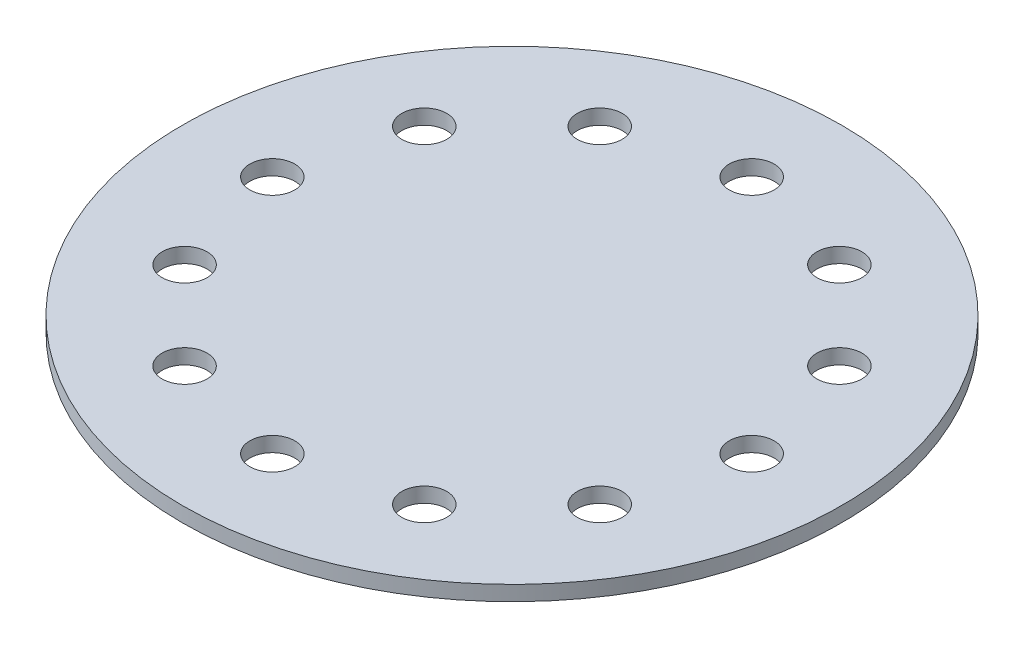
ISO-10303-21;
HEADER;
FILE_DESCRIPTION(('STEP AP214'),'2;1');
FILE_NAME('part.step','',(''),(''),'','','');
FILE_SCHEMA(('AUTOMOTIVE_DESIGN { 1 0 10303 214 1 1 1 1 }'));
ENDSEC;
DATA;
#1=APPLICATION_CONTEXT('core data for automotive mechanical design processes');
#2=APPLICATION_PROTOCOL_DEFINITION('international standard','automotive_design',2000,#1);
#3=PRODUCT_CONTEXT('',#1,'mechanical');
#4=PRODUCT('Part','Part','',(#3));
#5=PRODUCT_RELATED_PRODUCT_CATEGORY('part','',(#4));
#6=PRODUCT_DEFINITION_FORMATION('','',#4);
#7=PRODUCT_DEFINITION_CONTEXT('part definition',#1,'design');
#8=PRODUCT_DEFINITION('design','',#6,#7);
#9=PRODUCT_DEFINITION_SHAPE('','',#8);
#10=(LENGTH_UNIT() NAMED_UNIT(*) SI_UNIT(.MILLI.,.METRE.));
#11=(NAMED_UNIT(*) PLANE_ANGLE_UNIT() SI_UNIT($,.RADIAN.));
#12=(NAMED_UNIT(*) SI_UNIT($,.STERADIAN.) SOLID_ANGLE_UNIT());
#13=UNCERTAINTY_MEASURE_WITH_UNIT(LENGTH_MEASURE(1.E-05),#10,'distance_accuracy_value','');
#14=(GEOMETRIC_REPRESENTATION_CONTEXT(3) GLOBAL_UNCERTAINTY_ASSIGNED_CONTEXT((#13)) GLOBAL_UNIT_ASSIGNED_CONTEXT((#10,
#11,#12)) REPRESENTATION_CONTEXT('',''));
#15=CARTESIAN_POINT('',(0.,0.,0.));
#16=DIRECTION('',(0.,0.,1.));
#17=DIRECTION('',(1.,0.,0.));
#18=AXIS2_PLACEMENT_3D('',#15,#16,#17);
#19=CARTESIAN_POINT('',(0.,1.,0.));
#20=DIRECTION('',(0.,1.,0.));
#21=DIRECTION('',(0.,0.,1.));
#22=AXIS2_PLACEMENT_3D('',#19,#20,#21);
#23=PLANE('',#22);
#24=CARTESIAN_POINT('',(-13.8564064605507,1.,-7.9999999999994));
#25=DIRECTION('',(0.,1.,0.));
#26=DIRECTION('',(0.,0.,1.));
#27=AXIS2_PLACEMENT_3D('',#24,#25,#26);
#28=CIRCLE('',#27,1.50000000000069);
#29=CARTESIAN_POINT('',(-13.8564064605507,1.,-6.49999999999871));
#30=VERTEX_POINT('',#29);
#31=EDGE_CURVE('E132',#30,#30,#28,.T.);
#32=ORIENTED_EDGE('',*,*,#31,.F.);
#33=EDGE_LOOP('',(#32));
#34=FACE_BOUND('',#33,.T.);
#35=CARTESIAN_POINT('',(-13.85640646055,1.,8.0000000000006));
#36=DIRECTION('',(0.,1.,0.));
#37=DIRECTION('',(0.,0.,1.));
#38=AXIS2_PLACEMENT_3D('',#35,#36,#37);
#39=CIRCLE('',#38,1.50000000000129);
#40=CARTESIAN_POINT('',(-13.85640646055,1.,9.50000000000189));
#41=VERTEX_POINT('',#40);
#42=EDGE_CURVE('E116',#41,#41,#39,.T.);
#43=ORIENTED_EDGE('',*,*,#42,.F.);
#44=EDGE_LOOP('',(#43));
#45=FACE_BOUND('',#44,.T.);
#46=CARTESIAN_POINT('',(1.35836374802349E-12,1.,16.));
#47=DIRECTION('',(0.,1.,0.));
#48=DIRECTION('',(0.,0.,1.));
#49=AXIS2_PLACEMENT_3D('',#46,#47,#48);
#50=CIRCLE('',#49,1.50000000000141);
#51=CARTESIAN_POINT('',(1.35836374802349E-12,1.,17.5000000000014));
#52=VERTEX_POINT('',#51);
#53=EDGE_CURVE('E100',#52,#52,#50,.T.);
#54=ORIENTED_EDGE('',*,*,#53,.F.);
#55=EDGE_LOOP('',(#54));
#56=FACE_BOUND('',#55,.T.);
#57=CARTESIAN_POINT('',(13.856406460552,1.,7.99999999999941));
#58=DIRECTION('',(0.,1.,0.));
#59=DIRECTION('',(0.,0.,1.));
#60=AXIS2_PLACEMENT_3D('',#57,#58,#59);
#61=CIRCLE('',#60,1.50000000000088);
#62=CARTESIAN_POINT('',(13.856406460552,1.,9.50000000000029));
#63=VERTEX_POINT('',#62);
#64=EDGE_CURVE('E84',#63,#63,#61,.T.);
#65=ORIENTED_EDGE('',*,*,#64,.F.);
#66=EDGE_LOOP('',(#65));
#67=FACE_BOUND('',#66,.T.);
#68=CARTESIAN_POINT('',(13.8564064605514,1.,-8.00000000000059));
#69=DIRECTION('',(0.,1.,0.));
#70=DIRECTION('',(0.,0.,1.));
#71=AXIS2_PLACEMENT_3D('',#68,#69,#70);
#72=CIRCLE('',#71,1.50000000000019);
#73=CARTESIAN_POINT('',(13.8564064605514,1.,-6.5000000000004));
#74=VERTEX_POINT('',#73);
#75=EDGE_CURVE('E68',#74,#74,#72,.T.);
#76=ORIENTED_EDGE('',*,*,#75,.F.);
#77=EDGE_LOOP('',(#76));
#78=FACE_BOUND('',#77,.T.);
#79=CARTESIAN_POINT('',(0.,1.,-16.));
#80=DIRECTION('',(0.,1.,0.));
#81=DIRECTION('',(0.,0.,1.));
#82=AXIS2_PLACEMENT_3D('',#79,#80,#81);
#83=CIRCLE('',#82,1.5);
#84=CARTESIAN_POINT('',(0.,1.,-14.5));
#85=VERTEX_POINT('',#84);
#86=EDGE_CURVE('E54',#85,#85,#83,.T.);
#87=ORIENTED_EDGE('',*,*,#86,.F.);
#88=EDGE_LOOP('',(#87));
#89=FACE_BOUND('',#88,.T.);
#90=CARTESIAN_POINT('',(0.,1.,0.));
#91=DIRECTION('',(0.,1.,0.));
#92=DIRECTION('',(0.,0.,1.));
#93=AXIS2_PLACEMENT_3D('',#90,#91,#92);
#94=CIRCLE('',#93,22.);
#95=CARTESIAN_POINT('',(0.,1.,22.));
#96=VERTEX_POINT('',#95);
#97=EDGE_CURVE('E10',#96,#96,#94,.T.);
#98=ORIENTED_EDGE('',*,*,#97,.T.);
#99=EDGE_LOOP('',(#98));
#100=FACE_BOUND('',#99,.T.);
#101=CARTESIAN_POINT('',(8.00000000000002,1.,-13.856406460551));
#102=DIRECTION('',(0.,1.,0.));
#103=DIRECTION('',(0.,0.,1.));
#104=AXIS2_PLACEMENT_3D('',#101,#102,#103);
#105=CIRCLE('',#104,1.5);
#106=CARTESIAN_POINT('',(8.00000000000002,1.,-12.356406460551));
#107=VERTEX_POINT('',#106);
#108=EDGE_CURVE('E60',#107,#107,#105,.T.);
#109=ORIENTED_EDGE('',*,*,#108,.F.);
#110=EDGE_LOOP('',(#109));
#111=FACE_BOUND('',#110,.T.);
#112=CARTESIAN_POINT('',(16.0000000000007,1.,-6.79181874011743E-13));
#113=DIRECTION('',(0.,1.,0.));
#114=DIRECTION('',(0.,0.,1.));
#115=AXIS2_PLACEMENT_3D('',#112,#113,#114);
#116=CIRCLE('',#115,1.50000000000051);
#117=CARTESIAN_POINT('',(16.0000000000007,1.,1.49999999999983));
#118=VERTEX_POINT('',#117);
#119=EDGE_CURVE('E76',#118,#118,#116,.T.);
#120=ORIENTED_EDGE('',*,*,#119,.F.);
#121=EDGE_LOOP('',(#120));
#122=FACE_BOUND('',#121,.T.);
#123=CARTESIAN_POINT('',(8.00000000000127,1.,13.8564064605507));
#124=DIRECTION('',(0.,1.,0.));
#125=DIRECTION('',(0.,0.,1.));
#126=AXIS2_PLACEMENT_3D('',#123,#124,#125);
#127=CIRCLE('',#126,1.50000000000121);
#128=CARTESIAN_POINT('',(8.00000000000127,1.,15.3564064605519));
#129=VERTEX_POINT('',#128);
#130=EDGE_CURVE('E92',#129,#129,#127,.T.);
#131=ORIENTED_EDGE('',*,*,#130,.F.);
#132=EDGE_LOOP('',(#131));
#133=FACE_BOUND('',#132,.T.);
#134=CARTESIAN_POINT('',(-7.99999999999873,1.,13.8564064605514));
#135=DIRECTION('',(0.,1.,0.));
#136=DIRECTION('',(0.,0.,1.));
#137=AXIS2_PLACEMENT_3D('',#134,#135,#136);
#138=CIRCLE('',#137,1.50000000000144);
#139=CARTESIAN_POINT('',(-7.99999999999873,1.,15.3564064605528));
#140=VERTEX_POINT('',#139);
#141=EDGE_CURVE('E108',#140,#140,#138,.T.);
#142=ORIENTED_EDGE('',*,*,#141,.F.);
#143=EDGE_LOOP('',(#142));
#144=FACE_BOUND('',#143,.T.);
#145=CARTESIAN_POINT('',(-15.9999999999993,1.,6.81141308890378E-13));
#146=DIRECTION('',(0.,1.,0.));
#147=DIRECTION('',(0.,0.,1.));
#148=AXIS2_PLACEMENT_3D('',#145,#146,#147);
#149=CIRCLE('',#148,1.50000000000101);
#150=CARTESIAN_POINT('',(-15.9999999999993,1.,1.50000000000169));
#151=VERTEX_POINT('',#150);
#152=EDGE_CURVE('E124',#151,#151,#149,.T.);
#153=ORIENTED_EDGE('',*,*,#152,.F.);
#154=EDGE_LOOP('',(#153));
#155=FACE_BOUND('',#154,.T.);
#156=CARTESIAN_POINT('',(-7.99999999999982,1.,-13.8564064605511));
#157=DIRECTION('',(0.,1.,0.));
#158=DIRECTION('',(0.,0.,1.));
#159=AXIS2_PLACEMENT_3D('',#156,#157,#158);
#160=CIRCLE('',#159,1.5);
#161=CARTESIAN_POINT('',(-7.99999999999982,1.,-12.3564064605511));
#162=VERTEX_POINT('',#161);
#163=EDGE_CURVE('E140',#162,#162,#160,.T.);
#164=ORIENTED_EDGE('',*,*,#163,.F.);
#165=EDGE_LOOP('',(#164));
#166=FACE_BOUND('',#165,.T.);
#167=ADVANCED_FACE('F41',(#34,#45,#56,#67,#78,#89,#100,#111,#122,#133,#144,#155,#166),#23,.T.);
#168=CARTESIAN_POINT('',(0.,0.,0.));
#169=DIRECTION('',(0.,1.,0.));
#170=DIRECTION('',(0.,0.,1.));
#171=AXIS2_PLACEMENT_3D('',#168,#169,#170);
#172=PLANE('',#171);
#173=CARTESIAN_POINT('',(0.,0.,0.));
#174=DIRECTION('',(0.,1.,0.));
#175=DIRECTION('',(0.,0.,1.));
#176=AXIS2_PLACEMENT_3D('',#173,#174,#175);
#177=CIRCLE('',#176,22.);
#178=CARTESIAN_POINT('',(0.,0.,22.));
#179=VERTEX_POINT('',#178);
#180=EDGE_CURVE('E45',#179,#179,#177,.T.);
#181=ORIENTED_EDGE('',*,*,#180,.F.);
#182=EDGE_LOOP('',(#181));
#183=FACE_BOUND('',#182,.T.);
#184=CARTESIAN_POINT('',(0.,0.,-16.));
#185=DIRECTION('',(0.,1.,0.));
#186=DIRECTION('',(0.,0.,1.));
#187=AXIS2_PLACEMENT_3D('',#184,#185,#186);
#188=CIRCLE('',#187,1.5);
#189=CARTESIAN_POINT('',(0.,0.,-14.5));
#190=VERTEX_POINT('',#189);
#191=EDGE_CURVE('E56',#190,#190,#188,.T.);
#192=ORIENTED_EDGE('',*,*,#191,.T.);
#193=EDGE_LOOP('',(#192));
#194=FACE_BOUND('',#193,.T.);
#195=CARTESIAN_POINT('',(8.00000000000002,0.,-13.856406460551));
#196=DIRECTION('',(0.,1.,0.));
#197=DIRECTION('',(0.,0.,1.));
#198=AXIS2_PLACEMENT_3D('',#195,#196,#197);
#199=CIRCLE('',#198,1.5);
#200=CARTESIAN_POINT('',(8.00000000000002,0.,-12.356406460551));
#201=VERTEX_POINT('',#200);
#202=EDGE_CURVE('E64',#201,#201,#199,.T.);
#203=ORIENTED_EDGE('',*,*,#202,.T.);
#204=EDGE_LOOP('',(#203));
#205=FACE_BOUND('',#204,.T.);
#206=CARTESIAN_POINT('',(13.8564064605514,0.,-8.00000000000059));
#207=DIRECTION('',(0.,1.,0.));
#208=DIRECTION('',(0.,0.,1.));
#209=AXIS2_PLACEMENT_3D('',#206,#207,#208);
#210=CIRCLE('',#209,1.50000000000019);
#211=CARTESIAN_POINT('',(13.8564064605514,0.,-6.5000000000004));
#212=VERTEX_POINT('',#211);
#213=EDGE_CURVE('E72',#212,#212,#210,.T.);
#214=ORIENTED_EDGE('',*,*,#213,.T.);
#215=EDGE_LOOP('',(#214));
#216=FACE_BOUND('',#215,.T.);
#217=CARTESIAN_POINT('',(16.0000000000007,0.,-6.79181874011743E-13));
#218=DIRECTION('',(0.,1.,0.));
#219=DIRECTION('',(0.,0.,1.));
#220=AXIS2_PLACEMENT_3D('',#217,#218,#219);
#221=CIRCLE('',#220,1.50000000000051);
#222=CARTESIAN_POINT('',(16.0000000000007,0.,1.49999999999983));
#223=VERTEX_POINT('',#222);
#224=EDGE_CURVE('E80',#223,#223,#221,.T.);
#225=ORIENTED_EDGE('',*,*,#224,.T.);
#226=EDGE_LOOP('',(#225));
#227=FACE_BOUND('',#226,.T.);
#228=CARTESIAN_POINT('',(13.856406460552,0.,7.99999999999941));
#229=DIRECTION('',(0.,1.,0.));
#230=DIRECTION('',(0.,0.,1.));
#231=AXIS2_PLACEMENT_3D('',#228,#229,#230);
#232=CIRCLE('',#231,1.50000000000088);
#233=CARTESIAN_POINT('',(13.856406460552,0.,9.50000000000029));
#234=VERTEX_POINT('',#233);
#235=EDGE_CURVE('E88',#234,#234,#232,.T.);
#236=ORIENTED_EDGE('',*,*,#235,.T.);
#237=EDGE_LOOP('',(#236));
#238=FACE_BOUND('',#237,.T.);
#239=CARTESIAN_POINT('',(8.00000000000127,0.,13.8564064605507));
#240=DIRECTION('',(0.,1.,0.));
#241=DIRECTION('',(0.,0.,1.));
#242=AXIS2_PLACEMENT_3D('',#239,#240,#241);
#243=CIRCLE('',#242,1.50000000000121);
#244=CARTESIAN_POINT('',(8.00000000000127,0.,15.3564064605519));
#245=VERTEX_POINT('',#244);
#246=EDGE_CURVE('E96',#245,#245,#243,.T.);
#247=ORIENTED_EDGE('',*,*,#246,.T.);
#248=EDGE_LOOP('',(#247));
#249=FACE_BOUND('',#248,.T.);
#250=CARTESIAN_POINT('',(1.35836374802349E-12,0.,16.));
#251=DIRECTION('',(0.,1.,0.));
#252=DIRECTION('',(0.,0.,1.));
#253=AXIS2_PLACEMENT_3D('',#250,#251,#252);
#254=CIRCLE('',#253,1.50000000000141);
#255=CARTESIAN_POINT('',(1.35836374802349E-12,0.,17.5000000000014));
#256=VERTEX_POINT('',#255);
#257=EDGE_CURVE('E104',#256,#256,#254,.T.);
#258=ORIENTED_EDGE('',*,*,#257,.T.);
#259=EDGE_LOOP('',(#258));
#260=FACE_BOUND('',#259,.T.);
#261=CARTESIAN_POINT('',(-7.99999999999873,0.,13.8564064605514));
#262=DIRECTION('',(0.,1.,0.));
#263=DIRECTION('',(0.,0.,1.));
#264=AXIS2_PLACEMENT_3D('',#261,#262,#263);
#265=CIRCLE('',#264,1.50000000000144);
#266=CARTESIAN_POINT('',(-7.99999999999873,0.,15.3564064605528));
#267=VERTEX_POINT('',#266);
#268=EDGE_CURVE('E112',#267,#267,#265,.T.);
#269=ORIENTED_EDGE('',*,*,#268,.T.);
#270=EDGE_LOOP('',(#269));
#271=FACE_BOUND('',#270,.T.);
#272=CARTESIAN_POINT('',(-13.85640646055,0.,8.0000000000006));
#273=DIRECTION('',(0.,1.,0.));
#274=DIRECTION('',(0.,0.,1.));
#275=AXIS2_PLACEMENT_3D('',#272,#273,#274);
#276=CIRCLE('',#275,1.50000000000129);
#277=CARTESIAN_POINT('',(-13.85640646055,0.,9.50000000000189));
#278=VERTEX_POINT('',#277);
#279=EDGE_CURVE('E120',#278,#278,#276,.T.);
#280=ORIENTED_EDGE('',*,*,#279,.T.);
#281=EDGE_LOOP('',(#280));
#282=FACE_BOUND('',#281,.T.);
#283=CARTESIAN_POINT('',(-15.9999999999993,0.,6.81141308890378E-13));
#284=DIRECTION('',(0.,1.,0.));
#285=DIRECTION('',(0.,0.,1.));
#286=AXIS2_PLACEMENT_3D('',#283,#284,#285);
#287=CIRCLE('',#286,1.50000000000101);
#288=CARTESIAN_POINT('',(-15.9999999999993,0.,1.50000000000169));
#289=VERTEX_POINT('',#288);
#290=EDGE_CURVE('E128',#289,#289,#287,.T.);
#291=ORIENTED_EDGE('',*,*,#290,.T.);
#292=EDGE_LOOP('',(#291));
#293=FACE_BOUND('',#292,.T.);
#294=CARTESIAN_POINT('',(-13.8564064605507,0.,-7.9999999999994));
#295=DIRECTION('',(0.,1.,0.));
#296=DIRECTION('',(0.,0.,1.));
#297=AXIS2_PLACEMENT_3D('',#294,#295,#296);
#298=CIRCLE('',#297,1.50000000000069);
#299=CARTESIAN_POINT('',(-13.8564064605507,0.,-6.49999999999871));
#300=VERTEX_POINT('',#299);
#301=EDGE_CURVE('E136',#300,#300,#298,.T.);
#302=ORIENTED_EDGE('',*,*,#301,.T.);
#303=EDGE_LOOP('',(#302));
#304=FACE_BOUND('',#303,.T.);
#305=CARTESIAN_POINT('',(-7.99999999999982,0.,-13.8564064605511));
#306=DIRECTION('',(0.,1.,0.));
#307=DIRECTION('',(0.,0.,1.));
#308=AXIS2_PLACEMENT_3D('',#305,#306,#307);
#309=CIRCLE('',#308,1.5);
#310=CARTESIAN_POINT('',(-7.99999999999982,0.,-12.3564064605511));
#311=VERTEX_POINT('',#310);
#312=EDGE_CURVE('E144',#311,#311,#309,.T.);
#313=ORIENTED_EDGE('',*,*,#312,.T.);
#314=EDGE_LOOP('',(#313));
#315=FACE_BOUND('',#314,.T.);
#316=ADVANCED_FACE('F156',(#183,#194,#205,#216,#227,#238,#249,#260,#271,#282,#293,#304,#315),
#172,.F.);
#317=CARTESIAN_POINT('',(0.,1.,0.));
#318=DIRECTION('',(0.,-1.,0.));
#319=DIRECTION('',(0.,0.,-1.));
#320=AXIS2_PLACEMENT_3D('',#317,#318,#319);
#321=CYLINDRICAL_SURFACE('',#320,22.);
#322=ORIENTED_EDGE('',*,*,#97,.F.);
#323=EDGE_LOOP('',(#322));
#324=FACE_BOUND('',#323,.T.);
#325=ORIENTED_EDGE('',*,*,#180,.T.);
#326=EDGE_LOOP('',(#325));
#327=FACE_BOUND('',#326,.T.);
#328=ADVANCED_FACE('F43',(#324,#327),#321,.T.);
#329=CARTESIAN_POINT('',(0.,1.,-16.));
#330=DIRECTION('',(0.,-1.,0.));
#331=DIRECTION('',(0.,0.,-1.));
#332=AXIS2_PLACEMENT_3D('',#329,#330,#331);
#333=CYLINDRICAL_SURFACE('',#332,1.5);
#334=ORIENTED_EDGE('',*,*,#86,.T.);
#335=EDGE_LOOP('',(#334));
#336=FACE_BOUND('',#335,.T.);
#337=ORIENTED_EDGE('',*,*,#191,.F.);
#338=EDGE_LOOP('',(#337));
#339=FACE_BOUND('',#338,.T.);
#340=ADVANCED_FACE('F166',(#336,#339),#333,.F.);
#341=CARTESIAN_POINT('',(8.00000000000002,1.,-13.856406460551));
#342=DIRECTION('',(0.,-1.,0.));
#343=DIRECTION('',(0.,0.,-1.));
#344=AXIS2_PLACEMENT_3D('',#341,#342,#343);
#345=CYLINDRICAL_SURFACE('',#344,1.5);
#346=ORIENTED_EDGE('',*,*,#108,.T.);
#347=EDGE_LOOP('',(#346));
#348=FACE_BOUND('',#347,.T.);
#349=ORIENTED_EDGE('',*,*,#202,.F.);
#350=EDGE_LOOP('',(#349));
#351=FACE_BOUND('',#350,.T.);
#352=ADVANCED_FACE('F169',(#348,#351),#345,.F.);
#353=CARTESIAN_POINT('',(13.8564064605514,1.,-8.00000000000059));
#354=DIRECTION('',(0.,-1.,0.));
#355=DIRECTION('',(0.,0.,-1.));
#356=AXIS2_PLACEMENT_3D('',#353,#354,#355);
#357=CYLINDRICAL_SURFACE('',#356,1.50000000000019);
#358=ORIENTED_EDGE('',*,*,#75,.T.);
#359=EDGE_LOOP('',(#358));
#360=FACE_BOUND('',#359,.T.);
#361=ORIENTED_EDGE('',*,*,#213,.F.);
#362=EDGE_LOOP('',(#361));
#363=FACE_BOUND('',#362,.T.);
#364=ADVANCED_FACE('F173',(#360,#363),#357,.F.);
#365=CARTESIAN_POINT('',(16.0000000000007,1.,-6.79181874011743E-13));
#366=DIRECTION('',(0.,-1.,0.));
#367=DIRECTION('',(0.,0.,-1.));
#368=AXIS2_PLACEMENT_3D('',#365,#366,#367);
#369=CYLINDRICAL_SURFACE('',#368,1.50000000000051);
#370=ORIENTED_EDGE('',*,*,#119,.T.);
#371=EDGE_LOOP('',(#370));
#372=FACE_BOUND('',#371,.T.);
#373=ORIENTED_EDGE('',*,*,#224,.F.);
#374=EDGE_LOOP('',(#373));
#375=FACE_BOUND('',#374,.T.);
#376=ADVANCED_FACE('F177',(#372,#375),#369,.F.);
#377=CARTESIAN_POINT('',(13.856406460552,1.,7.99999999999941));
#378=DIRECTION('',(0.,-1.,0.));
#379=DIRECTION('',(0.,0.,-1.));
#380=AXIS2_PLACEMENT_3D('',#377,#378,#379);
#381=CYLINDRICAL_SURFACE('',#380,1.50000000000088);
#382=ORIENTED_EDGE('',*,*,#64,.T.);
#383=EDGE_LOOP('',(#382));
#384=FACE_BOUND('',#383,.T.);
#385=ORIENTED_EDGE('',*,*,#235,.F.);
#386=EDGE_LOOP('',(#385));
#387=FACE_BOUND('',#386,.T.);
#388=ADVANCED_FACE('F181',(#384,#387),#381,.F.);
#389=CARTESIAN_POINT('',(8.00000000000127,1.,13.8564064605507));
#390=DIRECTION('',(0.,-1.,0.));
#391=DIRECTION('',(0.,0.,-1.));
#392=AXIS2_PLACEMENT_3D('',#389,#390,#391);
#393=CYLINDRICAL_SURFACE('',#392,1.50000000000121);
#394=ORIENTED_EDGE('',*,*,#130,.T.);
#395=EDGE_LOOP('',(#394));
#396=FACE_BOUND('',#395,.T.);
#397=ORIENTED_EDGE('',*,*,#246,.F.);
#398=EDGE_LOOP('',(#397));
#399=FACE_BOUND('',#398,.T.);
#400=ADVANCED_FACE('F185',(#396,#399),#393,.F.);
#401=CARTESIAN_POINT('',(1.35836374802349E-12,1.,16.));
#402=DIRECTION('',(0.,-1.,0.));
#403=DIRECTION('',(0.,0.,-1.));
#404=AXIS2_PLACEMENT_3D('',#401,#402,#403);
#405=CYLINDRICAL_SURFACE('',#404,1.50000000000141);
#406=ORIENTED_EDGE('',*,*,#53,.T.);
#407=EDGE_LOOP('',(#406));
#408=FACE_BOUND('',#407,.T.);
#409=ORIENTED_EDGE('',*,*,#257,.F.);
#410=EDGE_LOOP('',(#409));
#411=FACE_BOUND('',#410,.T.);
#412=ADVANCED_FACE('F189',(#408,#411),#405,.F.);
#413=CARTESIAN_POINT('',(-7.99999999999873,1.,13.8564064605514));
#414=DIRECTION('',(0.,-1.,0.));
#415=DIRECTION('',(0.,0.,-1.));
#416=AXIS2_PLACEMENT_3D('',#413,#414,#415);
#417=CYLINDRICAL_SURFACE('',#416,1.50000000000144);
#418=ORIENTED_EDGE('',*,*,#141,.T.);
#419=EDGE_LOOP('',(#418));
#420=FACE_BOUND('',#419,.T.);
#421=ORIENTED_EDGE('',*,*,#268,.F.);
#422=EDGE_LOOP('',(#421));
#423=FACE_BOUND('',#422,.T.);
#424=ADVANCED_FACE('F193',(#420,#423),#417,.F.);
#425=CARTESIAN_POINT('',(-13.85640646055,1.,8.0000000000006));
#426=DIRECTION('',(0.,-1.,0.));
#427=DIRECTION('',(0.,0.,-1.));
#428=AXIS2_PLACEMENT_3D('',#425,#426,#427);
#429=CYLINDRICAL_SURFACE('',#428,1.50000000000129);
#430=ORIENTED_EDGE('',*,*,#42,.T.);
#431=EDGE_LOOP('',(#430));
#432=FACE_BOUND('',#431,.T.);
#433=ORIENTED_EDGE('',*,*,#279,.F.);
#434=EDGE_LOOP('',(#433));
#435=FACE_BOUND('',#434,.T.);
#436=ADVANCED_FACE('F197',(#432,#435),#429,.F.);
#437=CARTESIAN_POINT('',(-15.9999999999993,1.,6.81141308890378E-13));
#438=DIRECTION('',(0.,-1.,0.));
#439=DIRECTION('',(0.,0.,-1.));
#440=AXIS2_PLACEMENT_3D('',#437,#438,#439);
#441=CYLINDRICAL_SURFACE('',#440,1.50000000000101);
#442=ORIENTED_EDGE('',*,*,#152,.T.);
#443=EDGE_LOOP('',(#442));
#444=FACE_BOUND('',#443,.T.);
#445=ORIENTED_EDGE('',*,*,#290,.F.);
#446=EDGE_LOOP('',(#445));
#447=FACE_BOUND('',#446,.T.);
#448=ADVANCED_FACE('F201',(#444,#447),#441,.F.);
#449=CARTESIAN_POINT('',(-13.8564064605507,1.,-7.9999999999994));
#450=DIRECTION('',(0.,-1.,0.));
#451=DIRECTION('',(0.,0.,-1.));
#452=AXIS2_PLACEMENT_3D('',#449,#450,#451);
#453=CYLINDRICAL_SURFACE('',#452,1.50000000000069);
#454=ORIENTED_EDGE('',*,*,#31,.T.);
#455=EDGE_LOOP('',(#454));
#456=FACE_BOUND('',#455,.T.);
#457=ORIENTED_EDGE('',*,*,#301,.F.);
#458=EDGE_LOOP('',(#457));
#459=FACE_BOUND('',#458,.T.);
#460=ADVANCED_FACE('F205',(#456,#459),#453,.F.);
#461=CARTESIAN_POINT('',(-7.99999999999982,1.,-13.8564064605511));
#462=DIRECTION('',(0.,-1.,0.));
#463=DIRECTION('',(0.,0.,-1.));
#464=AXIS2_PLACEMENT_3D('',#461,#462,#463);
#465=CYLINDRICAL_SURFACE('',#464,1.5);
#466=ORIENTED_EDGE('',*,*,#163,.T.);
#467=EDGE_LOOP('',(#466));
#468=FACE_BOUND('',#467,.T.);
#469=ORIENTED_EDGE('',*,*,#312,.F.);
#470=EDGE_LOOP('',(#469));
#471=FACE_BOUND('',#470,.T.);
#472=ADVANCED_FACE('F152',(#468,#471),#465,.F.);
#473=CLOSED_SHELL('',(#167,#316,#328,#340,#352,#364,#376,#388,#400,#412,#424,#436,#448,#460,#472));
#474=MANIFOLD_SOLID_BREP('B2',#473);
#475=ADVANCED_BREP_SHAPE_REPRESENTATION('',(#18,#474),#14);
#476=SHAPE_DEFINITION_REPRESENTATION(#9,#475);
ENDSEC;
END-ISO-10303-21;
